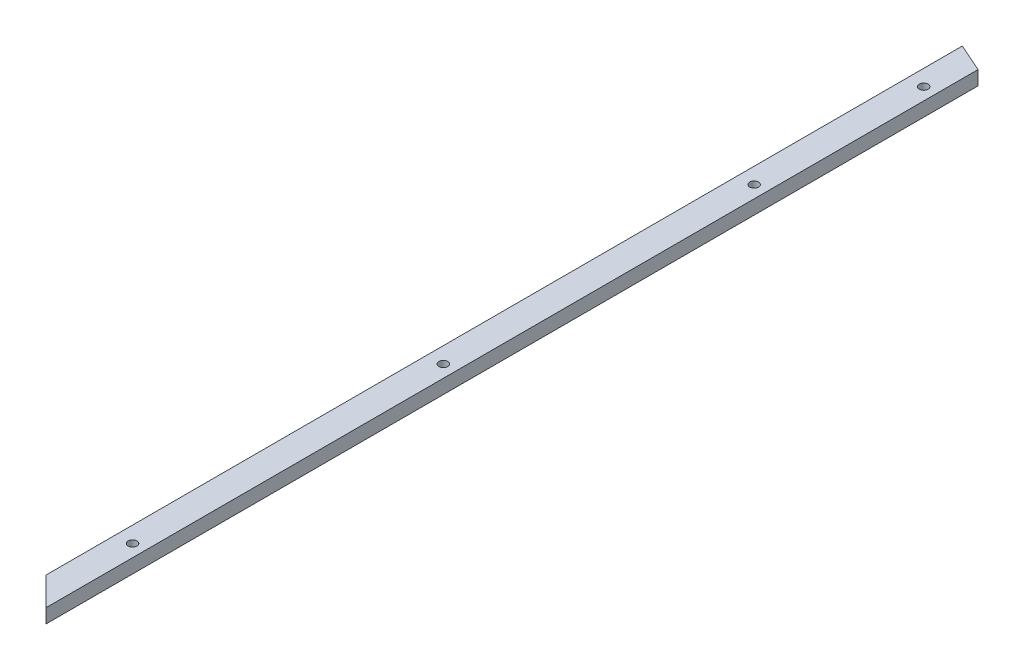
ISO-10303-21;
HEADER;
FILE_DESCRIPTION(('STEP AP214'),'2;1');
FILE_NAME('part.step','',(''),(''),'','','');
FILE_SCHEMA(('AUTOMOTIVE_DESIGN { 1 0 10303 214 1 1 1 1 }'));
ENDSEC;
DATA;
#1=APPLICATION_CONTEXT('core data for automotive mechanical design processes');
#2=APPLICATION_PROTOCOL_DEFINITION('international standard','automotive_design',2000,#1);
#3=PRODUCT_CONTEXT('',#1,'mechanical');
#4=PRODUCT('Part','Part','',(#3));
#5=PRODUCT_RELATED_PRODUCT_CATEGORY('part','',(#4));
#6=PRODUCT_DEFINITION_FORMATION('','',#4);
#7=PRODUCT_DEFINITION_CONTEXT('part definition',#1,'design');
#8=PRODUCT_DEFINITION('design','',#6,#7);
#9=PRODUCT_DEFINITION_SHAPE('','',#8);
#10=(LENGTH_UNIT() NAMED_UNIT(*) SI_UNIT(.MILLI.,.METRE.));
#11=(NAMED_UNIT(*) PLANE_ANGLE_UNIT() SI_UNIT($,.RADIAN.));
#12=(NAMED_UNIT(*) SI_UNIT($,.STERADIAN.) SOLID_ANGLE_UNIT());
#13=UNCERTAINTY_MEASURE_WITH_UNIT(LENGTH_MEASURE(1.E-05),#10,'distance_accuracy_value','');
#14=(GEOMETRIC_REPRESENTATION_CONTEXT(3) GLOBAL_UNCERTAINTY_ASSIGNED_CONTEXT((#13)) GLOBAL_UNIT_ASSIGNED_CONTEXT((#10,
#11,#12)) REPRESENTATION_CONTEXT('',''));
#15=CARTESIAN_POINT('',(0.,0.,0.));
#16=DIRECTION('',(0.,0.,1.));
#17=DIRECTION('',(1.,0.,0.));
#18=AXIS2_PLACEMENT_3D('',#15,#16,#17);
#19=CARTESIAN_POINT('',(-38.1,0.,1219.2));
#20=DIRECTION('',(0.,1.,0.));
#21=DIRECTION('',(0.,0.,1.));
#22=AXIS2_PLACEMENT_3D('',#19,#20,#21);
#23=PLANE('',#22);
#24=CARTESIAN_POINT('',(-11.1125,0.,457.2));
#25=DIRECTION('',(0.,1.,0.));
#26=DIRECTION('',(0.,0.,1.));
#27=AXIS2_PLACEMENT_3D('',#24,#25,#26);
#28=CIRCLE('',#27,3.96874999999999);
#29=CARTESIAN_POINT('',(-11.1125,0.,461.16875));
#30=VERTEX_POINT('',#29);
#31=EDGE_CURVE('E118',#30,#30,#28,.T.);
#32=ORIENTED_EDGE('',*,*,#31,.T.);
#33=EDGE_LOOP('',(#32));
#34=FACE_BOUND('',#33,.T.);
#35=CARTESIAN_POINT('',(-11.1125,0.,609.6));
#36=DIRECTION('',(0.,-1.,0.));
#37=DIRECTION('',(0.,0.,-1.));
#38=AXIS2_PLACEMENT_3D('',#35,#36,#37);
#39=CIRCLE('',#38,3.96875);
#40=CARTESIAN_POINT('',(-11.1125,0.,605.63125));
#41=VERTEX_POINT('',#40);
#42=EDGE_CURVE('E107',#41,#41,#39,.T.);
#43=ORIENTED_EDGE('',*,*,#42,.F.);
#44=EDGE_LOOP('',(#43));
#45=FACE_BOUND('',#44,.T.);
#46=CARTESIAN_POINT('',(-11.1125000000029,0.,889.));
#47=DIRECTION('',(0.,-1.,0.));
#48=DIRECTION('',(0.,0.,-1.));
#49=AXIS2_PLACEMENT_3D('',#46,#47,#48);
#50=CIRCLE('',#49,3.96875);
#51=CARTESIAN_POINT('',(-11.1125000000029,0.,885.03125));
#52=VERTEX_POINT('',#51);
#53=EDGE_CURVE('E101',#52,#52,#50,.T.);
#54=ORIENTED_EDGE('',*,*,#53,.F.);
#55=EDGE_LOOP('',(#54));
#56=FACE_BOUND('',#55,.T.);
#57=CARTESIAN_POINT('',(-11.1125000000059,0.,1168.4));
#58=DIRECTION('',(0.,-1.,0.));
#59=DIRECTION('',(0.,0.,-1.));
#60=AXIS2_PLACEMENT_3D('',#57,#58,#59);
#61=CIRCLE('',#60,3.96875);
#62=CARTESIAN_POINT('',(-11.1125000000059,0.,1164.43125));
#63=VERTEX_POINT('',#62);
#64=EDGE_CURVE('E95',#63,#63,#61,.T.);
#65=ORIENTED_EDGE('',*,*,#64,.F.);
#66=EDGE_LOOP('',(#65));
#67=FACE_BOUND('',#66,.T.);
#68=DIRECTION('',(0.,0.,-1.));
#69=VECTOR('',#68,1.);
#70=CARTESIAN_POINT('',(-38.1,0.,1219.2));
#71=LINE('',#70,#69);
#72=CARTESIAN_POINT('',(-38.1,0.,1219.2));
#73=VERTEX_POINT('',#72);
#74=CARTESIAN_POINT('',(-38.1,0.,402.533662089745));
#75=VERTEX_POINT('',#74);
#76=EDGE_CURVE('E87',#73,#75,#71,.T.);
#77=ORIENTED_EDGE('',*,*,#76,.T.);
#78=DIRECTION('',(-0.913545457642599,0.,-0.406736643075805));
#79=VECTOR('',#78,1.);
#80=CARTESIAN_POINT('',(-38.1,0.,402.533662089744));
#81=LINE('',#80,#79);
#82=CARTESIAN_POINT('',(0.,0.,419.496875));
#83=VERTEX_POINT('',#82);
#84=EDGE_CURVE('E46',#83,#75,#81,.T.);
#85=ORIENTED_EDGE('',*,*,#84,.F.);
#86=DIRECTION('',(0.,0.,-1.));
#87=VECTOR('',#86,1.);
#88=CARTESIAN_POINT('',(0.,0.,1219.2));
#89=LINE('',#88,#87);
#90=CARTESIAN_POINT('',(0.,0.,1257.3));
#91=VERTEX_POINT('',#90);
#92=EDGE_CURVE('E39',#91,#83,#89,.T.);
#93=ORIENTED_EDGE('',*,*,#92,.F.);
#94=DIRECTION('',(0.707106781186551,0.,0.707106781186544));
#95=VECTOR('',#94,1.);
#96=CARTESIAN_POINT('',(14.7142632281584,0.,1272.01426322816));
#97=LINE('',#96,#95);
#98=EDGE_CURVE('E110',#73,#91,#97,.T.);
#99=ORIENTED_EDGE('',*,*,#98,.F.);
#100=EDGE_LOOP('',(#77,#85,#93,#99));
#101=FACE_BOUND('',#100,.T.);
#102=ADVANCED_FACE('F32',(#34,#45,#56,#67,#101),#23,.F.);
#103=CARTESIAN_POINT('',(0.,0.,1219.2));
#104=DIRECTION('',(-1.,0.,0.));
#105=DIRECTION('',(0.,0.,1.));
#106=AXIS2_PLACEMENT_3D('',#103,#104,#105);
#107=PLANE('',#106);
#108=ORIENTED_EDGE('',*,*,#92,.T.);
#109=DIRECTION('',(0.,-1.,0.));
#110=VECTOR('',#109,1.);
#111=CARTESIAN_POINT('',(0.,12.7,419.496875));
#112=LINE('',#111,#110);
#113=CARTESIAN_POINT('',(0.,12.7,419.496875));
#114=VERTEX_POINT('',#113);
#115=EDGE_CURVE('E73',#114,#83,#112,.T.);
#116=ORIENTED_EDGE('',*,*,#115,.F.);
#117=DIRECTION('',(0.,0.,-1.));
#118=VECTOR('',#117,1.);
#119=CARTESIAN_POINT('',(0.,12.7,1219.2));
#120=LINE('',#119,#118);
#121=CARTESIAN_POINT('',(0.,12.7,1257.3));
#122=VERTEX_POINT('',#121);
#123=EDGE_CURVE('E80',#122,#114,#120,.T.);
#124=ORIENTED_EDGE('',*,*,#123,.F.);
#125=DIRECTION('',(0.,1.,0.));
#126=VECTOR('',#125,1.);
#127=CARTESIAN_POINT('',(0.,12.7,1257.3));
#128=LINE('',#127,#126);
#129=EDGE_CURVE('E111',#91,#122,#128,.T.);
#130=ORIENTED_EDGE('',*,*,#129,.F.);
#131=EDGE_LOOP('',(#108,#116,#124,#130));
#132=FACE_BOUND('',#131,.T.);
#133=ADVANCED_FACE('F78',(#132),#107,.F.);
#134=CARTESIAN_POINT('',(0.,12.7,1219.2));
#135=DIRECTION('',(0.,-1.,0.));
#136=DIRECTION('',(1.,0.,0.));
#137=AXIS2_PLACEMENT_3D('',#134,#135,#136);
#138=PLANE('',#137);
#139=CARTESIAN_POINT('',(-11.1125,12.7,457.2));
#140=DIRECTION('',(0.,1.,0.));
#141=DIRECTION('',(0.,0.,1.));
#142=AXIS2_PLACEMENT_3D('',#139,#140,#141);
#143=CIRCLE('',#142,3.96874999999999);
#144=CARTESIAN_POINT('',(-11.1125,12.7,461.16875));
#145=VERTEX_POINT('',#144);
#146=EDGE_CURVE('E122',#145,#145,#143,.T.);
#147=ORIENTED_EDGE('',*,*,#146,.F.);
#148=EDGE_LOOP('',(#147));
#149=FACE_BOUND('',#148,.T.);
#150=CARTESIAN_POINT('',(-11.1125,12.7,609.6));
#151=DIRECTION('',(0.,-1.,0.));
#152=DIRECTION('',(0.,0.,-1.));
#153=AXIS2_PLACEMENT_3D('',#150,#151,#152);
#154=CIRCLE('',#153,3.96875);
#155=CARTESIAN_POINT('',(-11.1125,12.7,605.63125));
#156=VERTEX_POINT('',#155);
#157=EDGE_CURVE('E104',#156,#156,#154,.T.);
#158=ORIENTED_EDGE('',*,*,#157,.T.);
#159=EDGE_LOOP('',(#158));
#160=FACE_BOUND('',#159,.T.);
#161=CARTESIAN_POINT('',(-11.1125000000029,12.7,889.));
#162=DIRECTION('',(0.,-1.,0.));
#163=DIRECTION('',(0.,0.,-1.));
#164=AXIS2_PLACEMENT_3D('',#161,#162,#163);
#165=CIRCLE('',#164,3.96875);
#166=CARTESIAN_POINT('',(-11.1125000000029,12.7,885.03125));
#167=VERTEX_POINT('',#166);
#168=EDGE_CURVE('E98',#167,#167,#165,.T.);
#169=ORIENTED_EDGE('',*,*,#168,.T.);
#170=EDGE_LOOP('',(#169));
#171=FACE_BOUND('',#170,.T.);
#172=CARTESIAN_POINT('',(-11.1125000000059,12.7,1168.4));
#173=DIRECTION('',(0.,-1.,0.));
#174=DIRECTION('',(0.,0.,-1.));
#175=AXIS2_PLACEMENT_3D('',#172,#173,#174);
#176=CIRCLE('',#175,3.96875);
#177=CARTESIAN_POINT('',(-11.1125000000059,12.7,1164.43125));
#178=VERTEX_POINT('',#177);
#179=EDGE_CURVE('E92',#178,#178,#176,.T.);
#180=ORIENTED_EDGE('',*,*,#179,.T.);
#181=EDGE_LOOP('',(#180));
#182=FACE_BOUND('',#181,.T.);
#183=ORIENTED_EDGE('',*,*,#123,.T.);
#184=DIRECTION('',(-0.913545457642599,0.,-0.406736643075805));
#185=VECTOR('',#184,1.);
#186=CARTESIAN_POINT('',(-38.1,12.7,402.533662089744));
#187=LINE('',#186,#185);
#188=CARTESIAN_POINT('',(-25.3999999999999,12.7,408.188066393163));
#189=VERTEX_POINT('',#188);
#190=EDGE_CURVE('E70',#114,#189,#187,.T.);
#191=ORIENTED_EDGE('',*,*,#190,.T.);
#192=DIRECTION('',(0.,0.,-1.));
#193=VECTOR('',#192,1.);
#194=CARTESIAN_POINT('',(-25.3999999999999,12.7,1219.2));
#195=LINE('',#194,#193);
#196=CARTESIAN_POINT('',(-25.3999999999999,12.7,1231.9));
#197=VERTEX_POINT('',#196);
#198=EDGE_CURVE('E54',#197,#189,#195,.T.);
#199=ORIENTED_EDGE('',*,*,#198,.F.);
#200=DIRECTION('',(-0.707106781186551,0.,-0.707106781186544));
#201=VECTOR('',#200,1.);
#202=CARTESIAN_POINT('',(2.01426322815829,12.7,1259.31426322816));
#203=LINE('',#202,#201);
#204=EDGE_CURVE('E85',#122,#197,#203,.T.);
#205=ORIENTED_EDGE('',*,*,#204,.F.);
#206=EDGE_LOOP('',(#183,#191,#199,#205));
#207=FACE_BOUND('',#206,.T.);
#208=ADVANCED_FACE('F84',(#149,#160,#171,#182,#207),#138,.F.);
#209=CARTESIAN_POINT('',(-25.3999999999999,12.7,1219.2));
#210=DIRECTION('',(0.707106781186544,-0.707106781186551,0.));
#211=DIRECTION('',(0.707106781186551,0.707106781186544,0.));
#212=AXIS2_PLACEMENT_3D('',#209,#210,#211);
#213=PLANE('',#212);
#214=ORIENTED_EDGE('',*,*,#198,.T.);
#215=DIRECTION('',(-0.67447145594718,-0.674471455947173,-0.300294039609502));
#216=VECTOR('',#215,1.);
#217=CARTESIAN_POINT('',(138.862160855171,176.962160855169,481.322292316651));
#218=LINE('',#217,#216);
#219=EDGE_CURVE('E11',#189,#75,#218,.T.);
#220=ORIENTED_EDGE('',*,*,#219,.T.);
#221=ORIENTED_EDGE('',*,*,#76,.F.);
#222=DIRECTION('',(-0.57735026918963,-0.577350269189624,-0.577350269189624));
#223=VECTOR('',#222,1.);
#224=CARTESIAN_POINT('',(-15.5904911812278,22.509508818772,1241.70950881877));
#225=LINE('',#224,#223);
#226=EDGE_CURVE('E82',#197,#73,#225,.T.);
#227=ORIENTED_EDGE('',*,*,#226,.F.);
#228=EDGE_LOOP('',(#214,#220,#221,#227));
#229=FACE_BOUND('',#228,.T.);
#230=ADVANCED_FACE('F130',(#229),#213,.F.);
#231=CARTESIAN_POINT('',(-11.1125000000059,0.,1168.4));
#232=DIRECTION('',(0.,-1.,0.));
#233=DIRECTION('',(0.,0.,-1.));
#234=AXIS2_PLACEMENT_3D('',#231,#232,#233);
#235=CYLINDRICAL_SURFACE('',#234,3.96875);
#236=ORIENTED_EDGE('',*,*,#179,.F.);
#237=EDGE_LOOP('',(#236));
#238=FACE_BOUND('',#237,.T.);
#239=ORIENTED_EDGE('',*,*,#64,.T.);
#240=EDGE_LOOP('',(#239));
#241=FACE_BOUND('',#240,.T.);
#242=ADVANCED_FACE('F138',(#238,#241),#235,.F.);
#243=CARTESIAN_POINT('',(-11.1125000000029,0.,889.));
#244=DIRECTION('',(0.,-1.,0.));
#245=DIRECTION('',(0.,0.,-1.));
#246=AXIS2_PLACEMENT_3D('',#243,#244,#245);
#247=CYLINDRICAL_SURFACE('',#246,3.96875);
#248=ORIENTED_EDGE('',*,*,#168,.F.);
#249=EDGE_LOOP('',(#248));
#250=FACE_BOUND('',#249,.T.);
#251=ORIENTED_EDGE('',*,*,#53,.T.);
#252=EDGE_LOOP('',(#251));
#253=FACE_BOUND('',#252,.T.);
#254=ADVANCED_FACE('F141',(#250,#253),#247,.F.);
#255=CARTESIAN_POINT('',(-11.1125,0.,609.6));
#256=DIRECTION('',(0.,-1.,0.));
#257=DIRECTION('',(0.,0.,-1.));
#258=AXIS2_PLACEMENT_3D('',#255,#256,#257);
#259=CYLINDRICAL_SURFACE('',#258,3.96875);
#260=ORIENTED_EDGE('',*,*,#157,.F.);
#261=EDGE_LOOP('',(#260));
#262=FACE_BOUND('',#261,.T.);
#263=ORIENTED_EDGE('',*,*,#42,.T.);
#264=EDGE_LOOP('',(#263));
#265=FACE_BOUND('',#264,.T.);
#266=ADVANCED_FACE('F154',(#262,#265),#259,.F.);
#267=CARTESIAN_POINT('',(-628.65,0.,628.650000000007));
#268=DIRECTION('',(0.707106781186544,0.,-0.707106781186551));
#269=DIRECTION('',(-0.707106781186551,0.,-0.707106781186544));
#270=AXIS2_PLACEMENT_3D('',#267,#268,#269);
#271=PLANE('',#270);
#272=ORIENTED_EDGE('',*,*,#129,.T.);
#273=ORIENTED_EDGE('',*,*,#204,.T.);
#274=ORIENTED_EDGE('',*,*,#226,.T.);
#275=ORIENTED_EDGE('',*,*,#98,.T.);
#276=EDGE_LOOP('',(#272,#273,#274,#275));
#277=FACE_BOUND('',#276,.T.);
#278=ADVANCED_FACE('F152',(#277),#271,.F.);
#279=CARTESIAN_POINT('',(-38.1,12.7,402.533662089744));
#280=DIRECTION('',(-0.406736643075805,0.,0.913545457642599));
#281=DIRECTION('',(0.913545457642599,0.,0.406736643075805));
#282=AXIS2_PLACEMENT_3D('',#279,#280,#281);
#283=PLANE('',#282);
#284=ORIENTED_EDGE('',*,*,#190,.F.);
#285=ORIENTED_EDGE('',*,*,#115,.T.);
#286=ORIENTED_EDGE('',*,*,#84,.T.);
#287=ORIENTED_EDGE('',*,*,#219,.F.);
#288=EDGE_LOOP('',(#284,#285,#286,#287));
#289=FACE_BOUND('',#288,.T.);
#290=ADVANCED_FACE('F72',(#289),#283,.F.);
#291=CARTESIAN_POINT('',(-11.1125,12.7,457.2));
#292=DIRECTION('',(0.,1.,0.));
#293=DIRECTION('',(0.,0.,1.));
#294=AXIS2_PLACEMENT_3D('',#291,#292,#293);
#295=CYLINDRICAL_SURFACE('',#294,3.96874999999999);
#296=ORIENTED_EDGE('',*,*,#31,.F.);
#297=EDGE_LOOP('',(#296));
#298=FACE_BOUND('',#297,.T.);
#299=ORIENTED_EDGE('',*,*,#146,.T.);
#300=EDGE_LOOP('',(#299));
#301=FACE_BOUND('',#300,.T.);
#302=ADVANCED_FACE('F126',(#298,#301),#295,.F.);
#303=CLOSED_SHELL('',(#102,#133,#208,#230,#242,#254,#266,#278,#290,#302));
#304=MANIFOLD_SOLID_BREP('B2',#303);
#305=ADVANCED_BREP_SHAPE_REPRESENTATION('',(#18,#304),#14);
#306=SHAPE_DEFINITION_REPRESENTATION(#9,#305);
ENDSEC;
END-ISO-10303-21;
